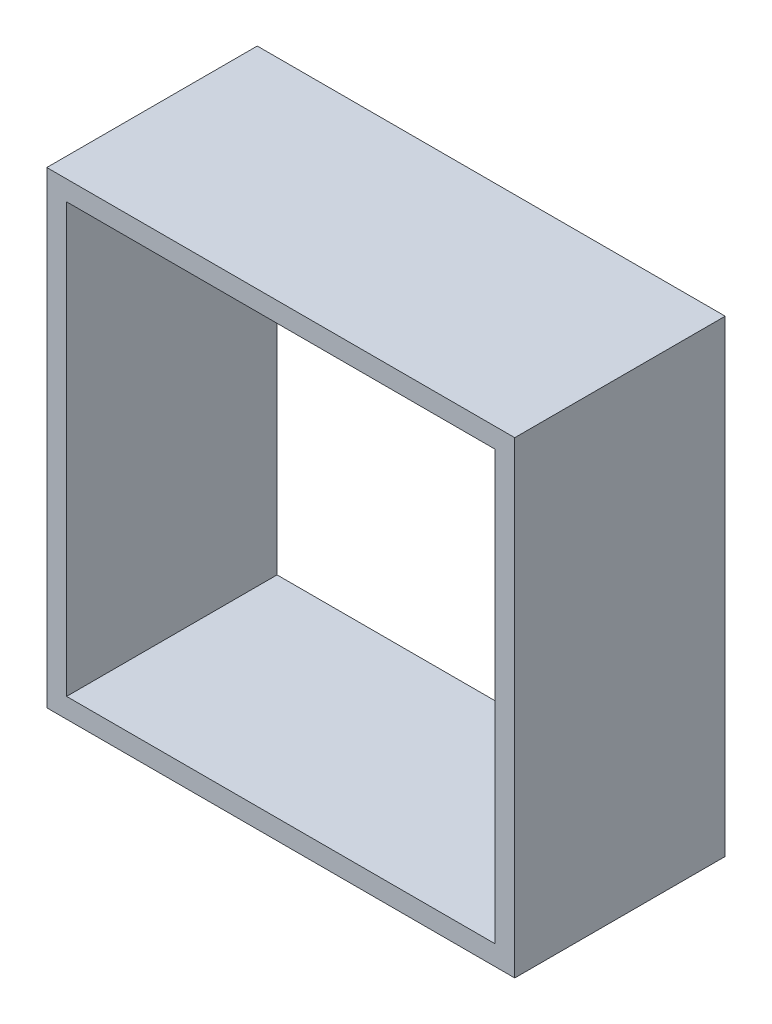
ISO-10303-21;
HEADER;
FILE_DESCRIPTION(('STEP AP214'),'2;1');
FILE_NAME('part.step','',(''),(''),'','','');
FILE_SCHEMA(('AUTOMOTIVE_DESIGN { 1 0 10303 214 1 1 1 1 }'));
ENDSEC;
DATA;
#1=APPLICATION_CONTEXT('core data for automotive mechanical design processes');
#2=APPLICATION_PROTOCOL_DEFINITION('international standard','automotive_design',2000,#1);
#3=PRODUCT_CONTEXT('',#1,'mechanical');
#4=PRODUCT('Part','Part','',(#3));
#5=PRODUCT_RELATED_PRODUCT_CATEGORY('part','',(#4));
#6=PRODUCT_DEFINITION_FORMATION('','',#4);
#7=PRODUCT_DEFINITION_CONTEXT('part definition',#1,'design');
#8=PRODUCT_DEFINITION('design','',#6,#7);
#9=PRODUCT_DEFINITION_SHAPE('','',#8);
#10=(LENGTH_UNIT() NAMED_UNIT(*) SI_UNIT(.MILLI.,.METRE.));
#11=(NAMED_UNIT(*) PLANE_ANGLE_UNIT() SI_UNIT($,.RADIAN.));
#12=(NAMED_UNIT(*) SI_UNIT($,.STERADIAN.) SOLID_ANGLE_UNIT());
#13=UNCERTAINTY_MEASURE_WITH_UNIT(LENGTH_MEASURE(1.E-05),#10,'distance_accuracy_value','');
#14=(GEOMETRIC_REPRESENTATION_CONTEXT(3) GLOBAL_UNCERTAINTY_ASSIGNED_CONTEXT((#13)) GLOBAL_UNIT_ASSIGNED_CONTEXT((#10,
#11,#12)) REPRESENTATION_CONTEXT('',''));
#15=CARTESIAN_POINT('',(0.,0.,0.));
#16=DIRECTION('',(0.,0.,1.));
#17=DIRECTION('',(1.,0.,0.));
#18=AXIS2_PLACEMENT_3D('',#15,#16,#17);
#19=CARTESIAN_POINT('',(0.,0.,8.5));
#20=DIRECTION('',(0.,0.,-1.));
#21=DIRECTION('',(-1.,0.,0.));
#22=AXIS2_PLACEMENT_3D('',#19,#20,#21);
#23=PLANE('',#22);
#24=DIRECTION('',(0.,1.,0.));
#25=VECTOR('',#24,1.);
#26=CARTESIAN_POINT('',(9.45,-9.45,8.5));
#27=LINE('',#26,#25);
#28=CARTESIAN_POINT('',(9.45,-9.45,8.5));
#29=VERTEX_POINT('',#28);
#30=CARTESIAN_POINT('',(9.45,9.45,8.5));
#31=VERTEX_POINT('',#30);
#32=EDGE_CURVE('E144',#29,#31,#27,.T.);
#33=ORIENTED_EDGE('',*,*,#32,.T.);
#34=DIRECTION('',(-1.,0.,0.));
#35=VECTOR('',#34,1.);
#36=CARTESIAN_POINT('',(-9.45,9.45,8.5));
#37=LINE('',#36,#35);
#38=CARTESIAN_POINT('',(-9.45,9.45,8.5));
#39=VERTEX_POINT('',#38);
#40=EDGE_CURVE('E147',#31,#39,#37,.T.);
#41=ORIENTED_EDGE('',*,*,#40,.T.);
#42=DIRECTION('',(0.,-1.,0.));
#43=VECTOR('',#42,1.);
#44=CARTESIAN_POINT('',(-9.45,-9.45,8.5));
#45=LINE('',#44,#43);
#46=CARTESIAN_POINT('',(-9.45,-9.45,8.5));
#47=VERTEX_POINT('',#46);
#48=EDGE_CURVE('E150',#39,#47,#45,.T.);
#49=ORIENTED_EDGE('',*,*,#48,.T.);
#50=DIRECTION('',(1.,0.,0.));
#51=VECTOR('',#50,1.);
#52=CARTESIAN_POINT('',(-9.45,-9.45,8.5));
#53=LINE('',#52,#51);
#54=EDGE_CURVE('E152',#47,#29,#53,.T.);
#55=ORIENTED_EDGE('',*,*,#54,.T.);
#56=EDGE_LOOP('',(#33,#41,#49,#55));
#57=FACE_BOUND('',#56,.T.);
#58=DIRECTION('',(0.,1.,0.));
#59=VECTOR('',#58,1.);
#60=CARTESIAN_POINT('',(8.65,-8.65,8.5));
#61=LINE('',#60,#59);
#62=CARTESIAN_POINT('',(8.65,-8.65,8.5));
#63=VERTEX_POINT('',#62);
#64=CARTESIAN_POINT('',(8.65,8.65,8.5));
#65=VERTEX_POINT('',#64);
#66=EDGE_CURVE('E108',#63,#65,#61,.T.);
#67=ORIENTED_EDGE('',*,*,#66,.F.);
#68=DIRECTION('',(1.,0.,0.));
#69=VECTOR('',#68,1.);
#70=CARTESIAN_POINT('',(-8.65000000000001,-8.65,8.5));
#71=LINE('',#70,#69);
#72=CARTESIAN_POINT('',(-8.65000000000001,-8.65,8.5));
#73=VERTEX_POINT('',#72);
#74=EDGE_CURVE('E130',#73,#63,#71,.T.);
#75=ORIENTED_EDGE('',*,*,#74,.F.);
#76=DIRECTION('',(0.,-1.,0.));
#77=VECTOR('',#76,1.);
#78=CARTESIAN_POINT('',(-8.65000000000001,-8.65,8.5));
#79=LINE('',#78,#77);
#80=CARTESIAN_POINT('',(-8.65000000000001,8.65,8.5));
#81=VERTEX_POINT('',#80);
#82=EDGE_CURVE('E128',#81,#73,#79,.T.);
#83=ORIENTED_EDGE('',*,*,#82,.F.);
#84=DIRECTION('',(-1.,0.,0.));
#85=VECTOR('',#84,1.);
#86=CARTESIAN_POINT('',(-8.65000000000001,8.65,8.5));
#87=LINE('',#86,#85);
#88=EDGE_CURVE('E116',#65,#81,#87,.T.);
#89=ORIENTED_EDGE('',*,*,#88,.F.);
#90=EDGE_LOOP('',(#67,#75,#83,#89));
#91=FACE_BOUND('',#90,.T.);
#92=ADVANCED_FACE('F43',(#57,#91),#23,.F.);
#93=CARTESIAN_POINT('',(0.,0.,0.));
#94=DIRECTION('',(0.,0.,-1.));
#95=DIRECTION('',(-1.,0.,0.));
#96=AXIS2_PLACEMENT_3D('',#93,#94,#95);
#97=PLANE('',#96);
#98=DIRECTION('',(0.,1.,0.));
#99=VECTOR('',#98,1.);
#100=CARTESIAN_POINT('',(9.45,-9.45,0.));
#101=LINE('',#100,#99);
#102=CARTESIAN_POINT('',(9.45,-9.45,0.));
#103=VERTEX_POINT('',#102);
#104=CARTESIAN_POINT('',(9.45,9.45,0.));
#105=VERTEX_POINT('',#104);
#106=EDGE_CURVE('E124',#103,#105,#101,.T.);
#107=ORIENTED_EDGE('',*,*,#106,.F.);
#108=DIRECTION('',(1.,0.,0.));
#109=VECTOR('',#108,1.);
#110=CARTESIAN_POINT('',(-9.45,-9.45,0.));
#111=LINE('',#110,#109);
#112=CARTESIAN_POINT('',(-9.45,-9.45,0.));
#113=VERTEX_POINT('',#112);
#114=EDGE_CURVE('E148',#113,#103,#111,.T.);
#115=ORIENTED_EDGE('',*,*,#114,.F.);
#116=DIRECTION('',(0.,-1.,0.));
#117=VECTOR('',#116,1.);
#118=CARTESIAN_POINT('',(-9.45,-9.45,0.));
#119=LINE('',#118,#117);
#120=CARTESIAN_POINT('',(-9.45,9.45,0.));
#121=VERTEX_POINT('',#120);
#122=EDGE_CURVE('E159',#121,#113,#119,.T.);
#123=ORIENTED_EDGE('',*,*,#122,.F.);
#124=DIRECTION('',(-1.,0.,0.));
#125=VECTOR('',#124,1.);
#126=CARTESIAN_POINT('',(-9.45,9.45,0.));
#127=LINE('',#126,#125);
#128=EDGE_CURVE('E157',#105,#121,#127,.T.);
#129=ORIENTED_EDGE('',*,*,#128,.F.);
#130=EDGE_LOOP('',(#107,#115,#123,#129));
#131=FACE_BOUND('',#130,.T.);
#132=DIRECTION('',(1.,0.,0.));
#133=VECTOR('',#132,1.);
#134=CARTESIAN_POINT('',(-8.65000000000001,-8.65,0.));
#135=LINE('',#134,#133);
#136=CARTESIAN_POINT('',(-8.65000000000001,-8.65,0.));
#137=VERTEX_POINT('',#136);
#138=CARTESIAN_POINT('',(8.65,-8.65,0.));
#139=VERTEX_POINT('',#138);
#140=EDGE_CURVE('E117',#137,#139,#135,.T.);
#141=ORIENTED_EDGE('',*,*,#140,.T.);
#142=DIRECTION('',(0.,1.,0.));
#143=VECTOR('',#142,1.);
#144=CARTESIAN_POINT('',(8.65,-8.65,0.));
#145=LINE('',#144,#143);
#146=CARTESIAN_POINT('',(8.65,8.65,0.));
#147=VERTEX_POINT('',#146);
#148=EDGE_CURVE('E66',#139,#147,#145,.T.);
#149=ORIENTED_EDGE('',*,*,#148,.T.);
#150=DIRECTION('',(-1.,0.,0.));
#151=VECTOR('',#150,1.);
#152=CARTESIAN_POINT('',(-8.65000000000001,8.65,0.));
#153=LINE('',#152,#151);
#154=CARTESIAN_POINT('',(-8.65000000000001,8.65,0.));
#155=VERTEX_POINT('',#154);
#156=EDGE_CURVE('E123',#147,#155,#153,.T.);
#157=ORIENTED_EDGE('',*,*,#156,.T.);
#158=DIRECTION('',(0.,-1.,0.));
#159=VECTOR('',#158,1.);
#160=CARTESIAN_POINT('',(-8.65000000000001,-8.65,0.));
#161=LINE('',#160,#159);
#162=EDGE_CURVE('E136',#155,#137,#161,.T.);
#163=ORIENTED_EDGE('',*,*,#162,.T.);
#164=EDGE_LOOP('',(#141,#149,#157,#163));
#165=FACE_BOUND('',#164,.T.);
#166=ADVANCED_FACE('F177',(#131,#165),#97,.T.);
#167=CARTESIAN_POINT('',(9.45,-9.45,8.5));
#168=DIRECTION('',(-1.,0.,0.));
#169=DIRECTION('',(0.,0.,1.));
#170=AXIS2_PLACEMENT_3D('',#167,#168,#169);
#171=PLANE('',#170);
#172=ORIENTED_EDGE('',*,*,#106,.T.);
#173=DIRECTION('',(0.,0.,-1.));
#174=VECTOR('',#173,1.);
#175=CARTESIAN_POINT('',(9.45,9.45,8.5));
#176=LINE('',#175,#174);
#177=EDGE_CURVE('E11',#31,#105,#176,.T.);
#178=ORIENTED_EDGE('',*,*,#177,.F.);
#179=ORIENTED_EDGE('',*,*,#32,.F.);
#180=DIRECTION('',(0.,0.,-1.));
#181=VECTOR('',#180,1.);
#182=CARTESIAN_POINT('',(9.45,-9.45,8.5));
#183=LINE('',#182,#181);
#184=EDGE_CURVE('E154',#29,#103,#183,.T.);
#185=ORIENTED_EDGE('',*,*,#184,.T.);
#186=EDGE_LOOP('',(#172,#178,#179,#185));
#187=FACE_BOUND('',#186,.T.);
#188=ADVANCED_FACE('F45',(#187),#171,.F.);
#189=CARTESIAN_POINT('',(-9.45,9.45,8.5));
#190=DIRECTION('',(0.,-1.,0.));
#191=DIRECTION('',(0.,0.,-1.));
#192=AXIS2_PLACEMENT_3D('',#189,#190,#191);
#193=PLANE('',#192);
#194=ORIENTED_EDGE('',*,*,#128,.T.);
#195=DIRECTION('',(0.,0.,-1.));
#196=VECTOR('',#195,1.);
#197=CARTESIAN_POINT('',(-9.45,9.45,8.5));
#198=LINE('',#197,#196);
#199=EDGE_CURVE('E51',#39,#121,#198,.T.);
#200=ORIENTED_EDGE('',*,*,#199,.F.);
#201=ORIENTED_EDGE('',*,*,#40,.F.);
#202=ORIENTED_EDGE('',*,*,#177,.T.);
#203=EDGE_LOOP('',(#194,#200,#201,#202));
#204=FACE_BOUND('',#203,.T.);
#205=ADVANCED_FACE('F187',(#204),#193,.F.);
#206=CARTESIAN_POINT('',(-9.45,-9.45,8.5));
#207=DIRECTION('',(1.,0.,0.));
#208=DIRECTION('',(0.,0.,-1.));
#209=AXIS2_PLACEMENT_3D('',#206,#207,#208);
#210=PLANE('',#209);
#211=ORIENTED_EDGE('',*,*,#122,.T.);
#212=DIRECTION('',(0.,0.,-1.));
#213=VECTOR('',#212,1.);
#214=CARTESIAN_POINT('',(-9.45,-9.45,8.5));
#215=LINE('',#214,#213);
#216=EDGE_CURVE('E164',#47,#113,#215,.T.);
#217=ORIENTED_EDGE('',*,*,#216,.F.);
#218=ORIENTED_EDGE('',*,*,#48,.F.);
#219=ORIENTED_EDGE('',*,*,#199,.T.);
#220=EDGE_LOOP('',(#211,#217,#218,#219));
#221=FACE_BOUND('',#220,.T.);
#222=ADVANCED_FACE('F171',(#221),#210,.F.);
#223=CARTESIAN_POINT('',(-9.45,-9.45,8.5));
#224=DIRECTION('',(0.,1.,0.));
#225=DIRECTION('',(0.,0.,1.));
#226=AXIS2_PLACEMENT_3D('',#223,#224,#225);
#227=PLANE('',#226);
#228=ORIENTED_EDGE('',*,*,#114,.T.);
#229=ORIENTED_EDGE('',*,*,#184,.F.);
#230=ORIENTED_EDGE('',*,*,#54,.F.);
#231=ORIENTED_EDGE('',*,*,#216,.T.);
#232=EDGE_LOOP('',(#228,#229,#230,#231));
#233=FACE_BOUND('',#232,.T.);
#234=ADVANCED_FACE('F181',(#233),#227,.F.);
#235=CARTESIAN_POINT('',(8.65,-8.65,8.5));
#236=DIRECTION('',(-1.,0.,0.));
#237=DIRECTION('',(0.,0.,1.));
#238=AXIS2_PLACEMENT_3D('',#235,#236,#237);
#239=PLANE('',#238);
#240=ORIENTED_EDGE('',*,*,#148,.F.);
#241=DIRECTION('',(0.,0.,-1.));
#242=VECTOR('',#241,1.);
#243=CARTESIAN_POINT('',(8.65,-8.65,8.5));
#244=LINE('',#243,#242);
#245=EDGE_CURVE('E112',#63,#139,#244,.T.);
#246=ORIENTED_EDGE('',*,*,#245,.F.);
#247=ORIENTED_EDGE('',*,*,#66,.T.);
#248=DIRECTION('',(0.,0.,-1.));
#249=VECTOR('',#248,1.);
#250=CARTESIAN_POINT('',(8.65,8.65,8.5));
#251=LINE('',#250,#249);
#252=EDGE_CURVE('E111',#65,#147,#251,.T.);
#253=ORIENTED_EDGE('',*,*,#252,.T.);
#254=EDGE_LOOP('',(#240,#246,#247,#253));
#255=FACE_BOUND('',#254,.T.);
#256=ADVANCED_FACE('F110',(#255),#239,.T.);
#257=CARTESIAN_POINT('',(-8.65000000000001,8.65,8.5));
#258=DIRECTION('',(0.,-1.,0.));
#259=DIRECTION('',(0.,0.,-1.));
#260=AXIS2_PLACEMENT_3D('',#257,#258,#259);
#261=PLANE('',#260);
#262=ORIENTED_EDGE('',*,*,#156,.F.);
#263=ORIENTED_EDGE('',*,*,#252,.F.);
#264=ORIENTED_EDGE('',*,*,#88,.T.);
#265=DIRECTION('',(0.,0.,-1.));
#266=VECTOR('',#265,1.);
#267=CARTESIAN_POINT('',(-8.65000000000001,8.65,8.5));
#268=LINE('',#267,#266);
#269=EDGE_CURVE('E125',#81,#155,#268,.T.);
#270=ORIENTED_EDGE('',*,*,#269,.T.);
#271=EDGE_LOOP('',(#262,#263,#264,#270));
#272=FACE_BOUND('',#271,.T.);
#273=ADVANCED_FACE('F120',(#272),#261,.T.);
#274=CARTESIAN_POINT('',(-8.65000000000001,-8.65,8.5));
#275=DIRECTION('',(1.,0.,0.));
#276=DIRECTION('',(0.,0.,-1.));
#277=AXIS2_PLACEMENT_3D('',#274,#275,#276);
#278=PLANE('',#277);
#279=ORIENTED_EDGE('',*,*,#162,.F.);
#280=ORIENTED_EDGE('',*,*,#269,.F.);
#281=ORIENTED_EDGE('',*,*,#82,.T.);
#282=DIRECTION('',(0.,0.,-1.));
#283=VECTOR('',#282,1.);
#284=CARTESIAN_POINT('',(-8.65000000000001,-8.65,8.5));
#285=LINE('',#284,#283);
#286=EDGE_CURVE('E58',#73,#137,#285,.T.);
#287=ORIENTED_EDGE('',*,*,#286,.T.);
#288=EDGE_LOOP('',(#279,#280,#281,#287));
#289=FACE_BOUND('',#288,.T.);
#290=ADVANCED_FACE('F210',(#289),#278,.T.);
#291=CARTESIAN_POINT('',(-8.65000000000001,-8.65,8.5));
#292=DIRECTION('',(0.,1.,0.));
#293=DIRECTION('',(0.,0.,1.));
#294=AXIS2_PLACEMENT_3D('',#291,#292,#293);
#295=PLANE('',#294);
#296=ORIENTED_EDGE('',*,*,#140,.F.);
#297=ORIENTED_EDGE('',*,*,#286,.F.);
#298=ORIENTED_EDGE('',*,*,#74,.T.);
#299=ORIENTED_EDGE('',*,*,#245,.T.);
#300=EDGE_LOOP('',(#296,#297,#298,#299));
#301=FACE_BOUND('',#300,.T.);
#302=ADVANCED_FACE('F214',(#301),#295,.T.);
#303=CLOSED_SHELL('',(#92,#166,#188,#205,#222,#234,#256,#273,#290,#302));
#304=MANIFOLD_SOLID_BREP('B2',#303);
#305=ADVANCED_BREP_SHAPE_REPRESENTATION('',(#18,#304),#14);
#306=SHAPE_DEFINITION_REPRESENTATION(#9,#305);
ENDSEC;
END-ISO-10303-21;
